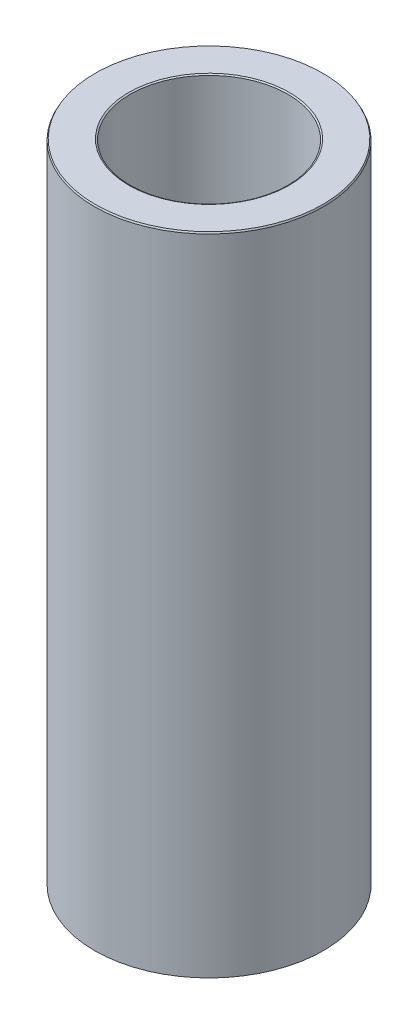
ISO-10303-21;
HEADER;
FILE_DESCRIPTION(('STEP AP214'),'2;1');
FILE_NAME('part.step','',(''),(''),'','','');
FILE_SCHEMA(('AUTOMOTIVE_DESIGN { 1 0 10303 214 1 1 1 1 }'));
ENDSEC;
DATA;
#1=APPLICATION_CONTEXT('core data for automotive mechanical design processes');
#2=APPLICATION_PROTOCOL_DEFINITION('international standard','automotive_design',2000,#1);
#3=PRODUCT_CONTEXT('',#1,'mechanical');
#4=PRODUCT('Part','Part','',(#3));
#5=PRODUCT_RELATED_PRODUCT_CATEGORY('part','',(#4));
#6=PRODUCT_DEFINITION_FORMATION('','',#4);
#7=PRODUCT_DEFINITION_CONTEXT('part definition',#1,'design');
#8=PRODUCT_DEFINITION('design','',#6,#7);
#9=PRODUCT_DEFINITION_SHAPE('','',#8);
#10=(LENGTH_UNIT() NAMED_UNIT(*) SI_UNIT(.MILLI.,.METRE.));
#11=(NAMED_UNIT(*) PLANE_ANGLE_UNIT() SI_UNIT($,.RADIAN.));
#12=(NAMED_UNIT(*) SI_UNIT($,.STERADIAN.) SOLID_ANGLE_UNIT());
#13=UNCERTAINTY_MEASURE_WITH_UNIT(LENGTH_MEASURE(1.E-05),#10,'distance_accuracy_value','');
#14=(GEOMETRIC_REPRESENTATION_CONTEXT(3) GLOBAL_UNCERTAINTY_ASSIGNED_CONTEXT((#13)) GLOBAL_UNIT_ASSIGNED_CONTEXT((#10,
#11,#12)) REPRESENTATION_CONTEXT('',''));
#15=CARTESIAN_POINT('',(0.,0.,0.));
#16=DIRECTION('',(0.,0.,1.));
#17=DIRECTION('',(1.,0.,0.));
#18=AXIS2_PLACEMENT_3D('',#15,#16,#17);
#19=CARTESIAN_POINT('',(0.,253.903079953156,0.));
#20=DIRECTION('',(0.,-1.,0.));
#21=DIRECTION('',(0.,0.,-1.));
#22=AXIS2_PLACEMENT_3D('',#19,#20,#21);
#23=CYLINDRICAL_SURFACE('',#22,45.);
#24=CARTESIAN_POINT('',(0.,0.334334335742037,0.));
#25=DIRECTION('',(0.,1.,0.));
#26=DIRECTION('',(0.,0.,1.));
#27=AXIS2_PLACEMENT_3D('',#24,#25,#26);
#28=CIRCLE('',#27,45.);
#29=CARTESIAN_POINT('',(0.,0.334334335742037,45.));
#30=VERTEX_POINT('',#29);
#31=EDGE_CURVE('E10',#30,#30,#28,.T.);
#32=ORIENTED_EDGE('',*,*,#31,.T.);
#33=EDGE_LOOP('',(#32));
#34=FACE_BOUND('',#33,.T.);
#35=CARTESIAN_POINT('',(0.,253.323995896936,0.));
#36=DIRECTION('',(0.,1.,0.));
#37=DIRECTION('',(0.,0.,1.));
#38=AXIS2_PLACEMENT_3D('',#35,#36,#37);
#39=CIRCLE('',#38,45.);
#40=CARTESIAN_POINT('',(0.,253.323995896936,45.));
#41=VERTEX_POINT('',#40);
#42=EDGE_CURVE('E50',#41,#41,#39,.F.);
#43=ORIENTED_EDGE('',*,*,#42,.T.);
#44=EDGE_LOOP('',(#43));
#45=FACE_BOUND('',#44,.T.);
#46=ADVANCED_FACE('F39',(#34,#45),#23,.T.);
#47=CARTESIAN_POINT('',(0.,253.903079953156,0.));
#48=DIRECTION('',(0.,1.,0.));
#49=DIRECTION('',(0.,0.,1.));
#50=AXIS2_PLACEMENT_3D('',#47,#48,#49);
#51=PLANE('',#50);
#52=CARTESIAN_POINT('',(0.,253.903079953156,0.));
#53=DIRECTION('',(0.,1.,0.));
#54=DIRECTION('',(0.,0.,1.));
#55=AXIS2_PLACEMENT_3D('',#52,#53,#54);
#56=CIRCLE('',#55,31.5584467220434);
#57=CARTESIAN_POINT('',(0.,253.903079953156,31.5584467220434));
#58=VERTEX_POINT('',#57);
#59=EDGE_CURVE('E58',#58,#58,#56,.F.);
#60=ORIENTED_EDGE('',*,*,#59,.T.);
#61=EDGE_LOOP('',(#60));
#62=FACE_BOUND('',#61,.T.);
#63=CARTESIAN_POINT('',(0.,253.903079953156,0.));
#64=DIRECTION('',(0.,1.,0.));
#65=DIRECTION('',(0.,0.,1.));
#66=AXIS2_PLACEMENT_3D('',#63,#64,#65);
#67=CIRCLE('',#66,44.6656656642579);
#68=CARTESIAN_POINT('',(0.,253.903079953156,44.6656656642579));
#69=VERTEX_POINT('',#68);
#70=EDGE_CURVE('E61',#69,#69,#67,.T.);
#71=ORIENTED_EDGE('',*,*,#70,.T.);
#72=EDGE_LOOP('',(#71));
#73=FACE_BOUND('',#72,.T.);
#74=ADVANCED_FACE('F88',(#62,#73),#51,.T.);
#75=CARTESIAN_POINT('',(0.,0.,0.));
#76=DIRECTION('',(0.,1.,0.));
#77=DIRECTION('',(0.,0.,1.));
#78=AXIS2_PLACEMENT_3D('',#75,#76,#77);
#79=PLANE('',#78);
#80=CARTESIAN_POINT('',(0.,0.,0.));
#81=DIRECTION('',(0.,1.,0.));
#82=DIRECTION('',(0.,0.,1.));
#83=AXIS2_PLACEMENT_3D('',#80,#81,#82);
#84=CIRCLE('',#83,31.3136970015655);
#85=CARTESIAN_POINT('',(0.,0.,-31.3136970015655));
#86=VERTEX_POINT('',#85);
#87=EDGE_CURVE('E51',#86,#86,#84,.T.);
#88=ORIENTED_EDGE('',*,*,#87,.T.);
#89=EDGE_LOOP('',(#88));
#90=FACE_BOUND('',#89,.T.);
#91=CARTESIAN_POINT('',(0.,0.,0.));
#92=DIRECTION('',(0.,1.,0.));
#93=DIRECTION('',(0.,0.,1.));
#94=AXIS2_PLACEMENT_3D('',#91,#92,#93);
#95=CIRCLE('',#94,44.42091594378);
#96=CARTESIAN_POINT('',(0.,0.,44.42091594378));
#97=VERTEX_POINT('',#96);
#98=EDGE_CURVE('E54',#97,#97,#95,.F.);
#99=ORIENTED_EDGE('',*,*,#98,.T.);
#100=EDGE_LOOP('',(#99));
#101=FACE_BOUND('',#100,.T.);
#102=ADVANCED_FACE('F83',(#90,#101),#79,.F.);
#103=CARTESIAN_POINT('',(0.,253.903079953156,0.));
#104=DIRECTION('',(0.,-1.,0.));
#105=DIRECTION('',(0.,0.,-1.));
#106=AXIS2_PLACEMENT_3D('',#103,#104,#105);
#107=CYLINDRICAL_SURFACE('',#106,30.9793626658235);
#108=CARTESIAN_POINT('',(0.,253.568745617414,0.));
#109=DIRECTION('',(0.,1.,0.));
#110=DIRECTION('',(0.,0.,1.));
#111=AXIS2_PLACEMENT_3D('',#108,#109,#110);
#112=CIRCLE('',#111,30.9793626658235);
#113=CARTESIAN_POINT('',(0.,253.568745617414,30.9793626658235));
#114=VERTEX_POINT('',#113);
#115=EDGE_CURVE('E67',#114,#114,#112,.T.);
#116=ORIENTED_EDGE('',*,*,#115,.T.);
#117=EDGE_LOOP('',(#116));
#118=FACE_BOUND('',#117,.T.);
#119=CARTESIAN_POINT('',(0.,0.579084056219981,0.));
#120=DIRECTION('',(0.,1.,0.));
#121=DIRECTION('',(0.,0.,1.));
#122=AXIS2_PLACEMENT_3D('',#119,#120,#121);
#123=CIRCLE('',#122,30.9793626658235);
#124=CARTESIAN_POINT('',(0.,0.57908405621998,-30.9793626658235));
#125=VERTEX_POINT('',#124);
#126=EDGE_CURVE('E69',#125,#125,#123,.F.);
#127=ORIENTED_EDGE('',*,*,#126,.T.);
#128=EDGE_LOOP('',(#127));
#129=FACE_BOUND('',#128,.T.);
#130=ADVANCED_FACE('F71',(#118,#129),#107,.F.);
#131=CARTESIAN_POINT('',(0.,253.568745617414,0.));
#132=DIRECTION('',(0.,1.,0.));
#133=DIRECTION('',(0.,0.,1.));
#134=AXIS2_PLACEMENT_3D('',#131,#132,#133);
#135=CONICAL_SURFACE('',#134,30.9793626658235,1.04719755119659);
#136=ORIENTED_EDGE('',*,*,#59,.F.);
#137=EDGE_LOOP('',(#136));
#138=FACE_BOUND('',#137,.T.);
#139=ORIENTED_EDGE('',*,*,#115,.F.);
#140=EDGE_LOOP('',(#139));
#141=FACE_BOUND('',#140,.T.);
#142=ADVANCED_FACE('F77',(#138,#141),#135,.F.);
#143=CARTESIAN_POINT('',(0.,0.,0.));
#144=DIRECTION('',(0.,-1.,0.));
#145=DIRECTION('',(0.,0.,-1.));
#146=AXIS2_PLACEMENT_3D('',#143,#144,#145);
#147=CONICAL_SURFACE('',#146,31.3136970015655,0.523598775598259);
#148=CARTESIAN_POINT('',(0.,0.57908405621998,-30.9793626658235));
#149=CARTESIAN_POINT('',(0.,0.573051930634356,-30.9828453151542));
#150=CARTESIAN_POINT('',(0.,0.567019805048731,-30.9863279644848));
#151=CARTESIAN_POINT('',(0.,0.554955553877481,-30.9932932631461));
#152=CARTESIAN_POINT('',(0.,0.548923428291856,-30.9967759124768));
#153=CARTESIAN_POINT('',(0.,0.536859177120607,-31.0037412111381));
#154=CARTESIAN_POINT('',(0.,0.530827051534982,-31.0072238604687));
#155=CARTESIAN_POINT('',(0.,0.518762800363733,-31.01418915913));
#156=CARTESIAN_POINT('',(0.,0.512730674778108,-31.0176718084607));
#157=CARTESIAN_POINT('',(0.,0.500666423606858,-31.0246371071219));
#158=CARTESIAN_POINT('',(0.,0.494634298021233,-31.0281197564526));
#159=CARTESIAN_POINT('',(0.,0.482570046849984,-31.0350850551139));
#160=CARTESIAN_POINT('',(0.,0.476537921264359,-31.0385677044445));
#161=CARTESIAN_POINT('',(0.,0.46447367009311,-31.0455330031058));
#162=CARTESIAN_POINT('',(0.,0.458441544507484,-31.0490156524365));
#163=CARTESIAN_POINT('',(0.,0.446377293336235,-31.0559809510977));
#164=CARTESIAN_POINT('',(0.,0.44034516775061,-31.0594636004284));
#165=CARTESIAN_POINT('',(0.,0.428280916579361,-31.0664288990897));
#166=CARTESIAN_POINT('',(0.,0.422248790993736,-31.0699115484203));
#167=CARTESIAN_POINT('',(0.,0.410184539822486,-31.0768768470816));
#168=CARTESIAN_POINT('',(0.,0.404152414236861,-31.0803594964123));
#169=CARTESIAN_POINT('',(0.,0.392088163065612,-31.0873247950736));
#170=CARTESIAN_POINT('',(0.,0.386056037479987,-31.0908074444042));
#171=CARTESIAN_POINT('',(0.,0.373991786308738,-31.0977727430655));
#172=CARTESIAN_POINT('',(0.,0.367959660723113,-31.1012553923962));
#173=CARTESIAN_POINT('',(0.,0.355895409551863,-31.1082206910574));
#174=CARTESIAN_POINT('',(0.,0.349863283966238,-31.1117033403881));
#175=CARTESIAN_POINT('',(0.,0.337799032794988,-31.1186686390494));
#176=CARTESIAN_POINT('',(0.,0.331766907209364,-31.12215128838));
#177=CARTESIAN_POINT('',(0.,0.319702656038114,-31.1291165870413));
#178=CARTESIAN_POINT('',(0.,0.313670530452489,-31.132599236372));
#179=CARTESIAN_POINT('',(0.,0.301606279281239,-31.1395645350332));
#180=CARTESIAN_POINT('',(0.,0.295574153695615,-31.1430471843639));
#181=CARTESIAN_POINT('',(0.,0.283509902524366,-31.1500124830252));
#182=CARTESIAN_POINT('',(0.,0.277477776938741,-31.1534951323558));
#183=CARTESIAN_POINT('',(0.,0.265413525767491,-31.1604604310171));
#184=CARTESIAN_POINT('',(0.,0.259381400181866,-31.1639430803478));
#185=CARTESIAN_POINT('',(0.,0.247317149010616,-31.1709083790091));
#186=CARTESIAN_POINT('',(0.,0.241285023424992,-31.1743910283397));
#187=CARTESIAN_POINT('',(0.,0.229220772253743,-31.181356327001));
#188=CARTESIAN_POINT('',(0.,0.223188646668117,-31.1848389763316));
#189=CARTESIAN_POINT('',(0.,0.211124395496868,-31.1918042749929));
#190=CARTESIAN_POINT('',(0.,0.205092269911243,-31.1952869243236));
#191=CARTESIAN_POINT('',(0.,0.193028018739994,-31.2022522229849));
#192=CARTESIAN_POINT('',(0.,0.186995893154369,-31.2057348723155));
#193=CARTESIAN_POINT('',(0.,0.174931641983119,-31.2127001709768));
#194=CARTESIAN_POINT('',(0.,0.168899516397494,-31.2161828203075));
#195=CARTESIAN_POINT('',(0.,0.156835265226244,-31.2231481189688));
#196=CARTESIAN_POINT('',(0.,0.15080313964062,-31.2266307682994));
#197=CARTESIAN_POINT('',(0.,0.13873888846937,-31.2335960669607));
#198=CARTESIAN_POINT('',(0.,0.132706762883746,-31.2370787162913));
#199=CARTESIAN_POINT('',(0.,0.120642511712496,-31.2440440149526));
#200=CARTESIAN_POINT('',(0.,0.114610386126871,-31.2475266642833));
#201=CARTESIAN_POINT('',(0.,0.102546134955621,-31.2544919629446));
#202=CARTESIAN_POINT('',(0.,0.0965140093699967,-31.2579746122752));
#203=CARTESIAN_POINT('',(0.,0.0844497581987472,-31.2649399109365));
#204=CARTESIAN_POINT('',(0.,0.0784176326131222,-31.2684225602671));
#205=CARTESIAN_POINT('',(0.,0.0663533814418729,-31.2753878589284));
#206=CARTESIAN_POINT('',(0.,0.0603212558562486,-31.2788705082591));
#207=CARTESIAN_POINT('',(0.,0.0482570046849988,-31.2858358069204));
#208=CARTESIAN_POINT('',(0.,0.0422248790993733,-31.289318456251));
#209=CARTESIAN_POINT('',(0.,0.0301606279281233,-31.2962837549123));
#210=CARTESIAN_POINT('',(0.,0.0241285023424988,-31.299766404243));
#211=CARTESIAN_POINT('',(0.,0.0120642511712499,-31.3067317029042));
#212=CARTESIAN_POINT('',(0.,0.00603212558562548,-31.3102143522349));
#213=CARTESIAN_POINT('',(0.,0.,-31.3136970015655));
#214=B_SPLINE_CURVE_WITH_KNOTS('',3,(#148,#149,#150,#151,#152,#153,#154,#155,#156,#157,#158,
#159,#160,#161,#162,#163,#164,#165,#166,#167,#168,#169,#170,#171,#172,#173,#174,#175,#176,#177,
#178,#179,#180,#181,#182,#183,#184,#185,#186,#187,#188,#189,#190,#191,#192,#193,#194,#195,#196,
#197,#198,#199,#200,#201,#202,#203,#204,#205,#206,#207,#208,#209,#210,#211,#212,#213),
.UNSPECIFIED.,.F.,.F.,(4,2,2,2,2,2,2,2,2,2,2,2,2,2,2,2,2,2,2,2,2,2,2,2,2,2,2,2,2,2,2,2,4),(0.,
0.0208958959838768,0.0417917919677519,0.0626876879516287,0.0835835839355055,0.104479479919381,
0.125375375903257,0.146271271887132,0.167167167871009,0.188063063854886,0.208958959838761,
0.229854855822638,0.250750751806515,0.27164664779039,0.292542543774267,0.313438439758142,
0.334334335742018,0.355230231725895,0.37612612770977,0.397022023693647,0.417917919677522,
0.438813815661399,0.459709711645276,0.480605607629151,0.501501503613028,0.522397399596905,
0.54329329558078,0.564189191564656,0.585085087548533,0.60598098353241,0.626876879516283,
0.64777277550016,0.668668671484037),.UNSPECIFIED.);
#215=EDGE_CURVE('BSEAM73',#125,#86,#214,.T.);
#216=ORIENTED_EDGE('',*,*,#126,.F.);
#217=ORIENTED_EDGE('',*,*,#87,.F.);
#218=ORIENTED_EDGE('',*,*,#215,.T.);
#219=ORIENTED_EDGE('',*,*,#215,.F.);
#220=EDGE_LOOP('',(#216,#218,#217,#219));
#221=FACE_BOUND('',#220,.T.);
#222=ADVANCED_FACE('F73',(#221),#147,.F.);
#223=CARTESIAN_POINT('',(0.,0.334334335742037,0.));
#224=DIRECTION('',(0.,1.,0.));
#225=DIRECTION('',(0.,0.,1.));
#226=AXIS2_PLACEMENT_3D('',#223,#224,#225);
#227=CONICAL_SURFACE('',#226,45.,1.04719755119662);
#228=CARTESIAN_POINT('',(0.,0.,44.42091594378));
#229=CARTESIAN_POINT('',(0.,0.00348264933064469,44.4269480693656));
#230=CARTESIAN_POINT('',(0.,0.00696529866129139,44.4329801949512));
#231=CARTESIAN_POINT('',(0.,0.0139305973225848,44.4450444461225));
#232=CARTESIAN_POINT('',(0.,0.0174132466532315,44.4510765717081));
#233=CARTESIAN_POINT('',(0.,0.024378545314524,44.4631408228794));
#234=CARTESIAN_POINT('',(0.,0.0278611946451698,44.469172948465));
#235=CARTESIAN_POINT('',(0.,0.034826493306462,44.4812371996362));
#236=CARTESIAN_POINT('',(0.,0.0383091426371085,44.4872693252219));
#237=CARTESIAN_POINT('',(0.,0.0452744412984007,44.4993335763931));
#238=CARTESIAN_POINT('',(0.,0.0487570906290464,44.5053657019787));
#239=CARTESIAN_POINT('',(0.,0.0557223892903391,44.51742995315));
#240=CARTESIAN_POINT('',(0.,0.059205038620986,44.5234620787356));
#241=CARTESIAN_POINT('',(0.,0.0661703372822788,44.5355263299069));
#242=CARTESIAN_POINT('',(0.,0.0696529866129247,44.5415584554925));
#243=CARTESIAN_POINT('',(0.,0.0766182852742164,44.5536227066637));
#244=CARTESIAN_POINT('',(0.,0.0801009346048623,44.5596548322494));
#245=CARTESIAN_POINT('',(0.,0.0870662332661551,44.5717190834206));
#246=CARTESIAN_POINT('',(0.,0.090548882596802,44.5777512090062));
#247=CARTESIAN_POINT('',(0.,0.0975141812580946,44.5898154601775));
#248=CARTESIAN_POINT('',(0.,0.10099683058874,44.5958475857631));
#249=CARTESIAN_POINT('',(0.,0.107962129250033,44.6079118369344));
#250=CARTESIAN_POINT('',(0.,0.111444778580679,44.61394396252));
#251=CARTESIAN_POINT('',(0.,0.118410077241971,44.6260082136912));
#252=CARTESIAN_POINT('',(0.,0.121892726572617,44.6320403392769));
#253=CARTESIAN_POINT('',(0.,0.12885802523391,44.6441045904481));
#254=CARTESIAN_POINT('',(0.,0.132340674564557,44.6501367160337));
#255=CARTESIAN_POINT('',(0.,0.139305973225849,44.662200967205));
#256=CARTESIAN_POINT('',(0.,0.142788622556495,44.6682330927906));
#257=CARTESIAN_POINT('',(0.,0.149753921217787,44.6802973439619));
#258=CARTESIAN_POINT('',(0.,0.153236570548433,44.6863294695475));
#259=CARTESIAN_POINT('',(0.,0.160201869209726,44.6983937207187));
#260=CARTESIAN_POINT('',(0.,0.163684518540373,44.7044258463044));
#261=CARTESIAN_POINT('',(0.,0.170649817201665,44.7164900974756));
#262=CARTESIAN_POINT('',(0.,0.174132466532311,44.7225222230612));
#263=CARTESIAN_POINT('',(0.,0.181097765193603,44.7345864742325));
#264=CARTESIAN_POINT('',(0.,0.18458041452425,44.7406185998181));
#265=CARTESIAN_POINT('',(0.,0.191545713185542,44.7526828509894));
#266=CARTESIAN_POINT('',(0.,0.195028362516188,44.758714976575));
#267=CARTESIAN_POINT('',(0.,0.20199366117748,44.7707792277462));
#268=CARTESIAN_POINT('',(0.,0.205476310508127,44.7768113533319));
#269=CARTESIAN_POINT('',(0.,0.21244160916942,44.7888756045031));
#270=CARTESIAN_POINT('',(0.,0.215924258500066,44.7949077300887));
#271=CARTESIAN_POINT('',(0.,0.222889557161358,44.80697198126));
#272=CARTESIAN_POINT('',(0.,0.226372206492004,44.8130041068456));
#273=CARTESIAN_POINT('',(0.,0.233337505153296,44.8250683580169));
#274=CARTESIAN_POINT('',(0.,0.236820154483942,44.8311004836025));
#275=CARTESIAN_POINT('',(0.,0.243785453145235,44.8431647347737));
#276=CARTESIAN_POINT('',(0.,0.247268102475882,44.8491968603594));
#277=CARTESIAN_POINT('',(0.,0.254233401137175,44.8612611115306));
#278=CARTESIAN_POINT('',(0.,0.25771605046782,44.8672932371162));
#279=CARTESIAN_POINT('',(0.,0.264681349129112,44.8793574882875));
#280=CARTESIAN_POINT('',(0.,0.268163998459758,44.8853896138731));
#281=CARTESIAN_POINT('',(0.,0.275129297121051,44.8974538650444));
#282=CARTESIAN_POINT('',(0.,0.278611946451698,44.90348599063));
#283=CARTESIAN_POINT('',(0.,0.28557724511299,44.9155502418012));
#284=CARTESIAN_POINT('',(0.,0.289059894443636,44.9215823673869));
#285=CARTESIAN_POINT('',(0.,0.296025193104928,44.9336466185581));
#286=CARTESIAN_POINT('',(0.,0.299507842435575,44.9396787441437));
#287=CARTESIAN_POINT('',(0.,0.306473141096867,44.951742995315));
#288=CARTESIAN_POINT('',(0.,0.309955790427513,44.9577751209006));
#289=CARTESIAN_POINT('',(0.,0.316921089088805,44.9698393720719));
#290=CARTESIAN_POINT('',(0.,0.320403738419452,44.9758714976575));
#291=CARTESIAN_POINT('',(0.,0.327369037080745,44.9879357488288));
#292=CARTESIAN_POINT('',(0.,0.330851686411392,44.9939678744144));
#293=CARTESIAN_POINT('',(0.,0.334334335742037,45.));
#294=B_SPLINE_CURVE_WITH_KNOTS('',3,(#228,#229,#230,#231,#232,#233,#234,#235,#236,#237,#238,
#239,#240,#241,#242,#243,#244,#245,#246,#247,#248,#249,#250,#251,#252,#253,#254,#255,#256,#257,
#258,#259,#260,#261,#262,#263,#264,#265,#266,#267,#268,#269,#270,#271,#272,#273,#274,#275,#276,
#277,#278,#279,#280,#281,#282,#283,#284,#285,#286,#287,#288,#289,#290,#291,#292,#293),
.UNSPECIFIED.,.F.,.F.,(4,2,2,2,2,2,2,2,2,2,2,2,2,2,2,2,2,2,2,2,2,2,2,2,2,2,2,2,2,2,2,2,4),(0.,
0.0208958959838798,0.0417917919677536,0.0626876879516334,0.0835835839355132,0.104479479919393,
0.125375375903267,0.146271271887147,0.167167167871026,0.1880630638549,0.20895895983878,
0.22985485582266,0.25075075180654,0.271646647790413,0.292542543774293,0.313438439758173,
0.334334335742047,0.355230231725927,0.376126127709806,0.397022023693686,0.41791791967756,
0.43881381566144,0.45970971164532,0.480605607629199,0.501501503613073,0.522397399596953,
0.543293295580833,0.564189191564707,0.585085087548586,0.605980983532466,0.626876879516346,
0.64777277550022,0.6686686714841),.UNSPECIFIED.);
#295=EDGE_CURVE('BSEAM76',#97,#30,#294,.T.);
#296=ORIENTED_EDGE('',*,*,#98,.F.);
#297=ORIENTED_EDGE('',*,*,#31,.F.);
#298=ORIENTED_EDGE('',*,*,#295,.T.);
#299=ORIENTED_EDGE('',*,*,#295,.F.);
#300=EDGE_LOOP('',(#296,#298,#297,#299));
#301=FACE_BOUND('',#300,.T.);
#302=ADVANCED_FACE('F76',(#301),#227,.T.);
#303=CARTESIAN_POINT('',(0.,253.903079953156,0.));
#304=DIRECTION('',(0.,-1.,0.));
#305=DIRECTION('',(0.,0.,-1.));
#306=AXIS2_PLACEMENT_3D('',#303,#304,#305);
#307=CONICAL_SURFACE('',#306,44.6656656642579,0.523598775598287);
#308=ORIENTED_EDGE('',*,*,#42,.F.);
#309=EDGE_LOOP('',(#308));
#310=FACE_BOUND('',#309,.T.);
#311=ORIENTED_EDGE('',*,*,#70,.F.);
#312=EDGE_LOOP('',(#311));
#313=FACE_BOUND('',#312,.T.);
#314=ADVANCED_FACE('F45',(#310,#313),#307,.T.);
#315=CLOSED_SHELL('',(#46,#74,#102,#130,#142,#222,#302,#314));
#316=MANIFOLD_SOLID_BREP('B2',#315);
#317=ADVANCED_BREP_SHAPE_REPRESENTATION('',(#18,#316),#14);
#318=SHAPE_DEFINITION_REPRESENTATION(#9,#317);
ENDSEC;
END-ISO-10303-21;
